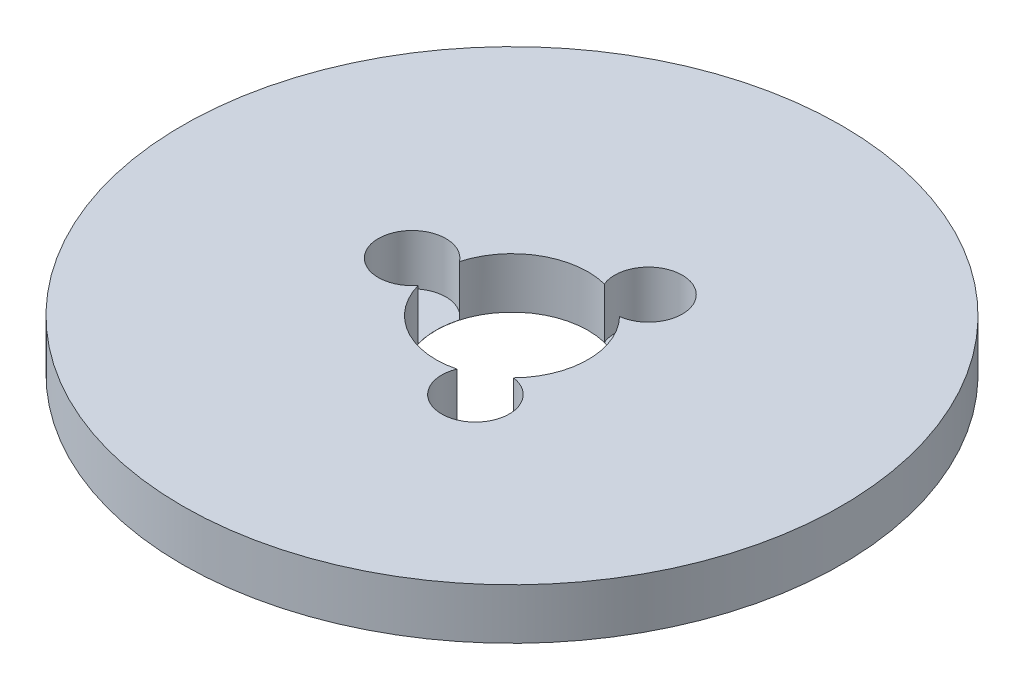
ISO-10303-21;
HEADER;
FILE_DESCRIPTION(('STEP AP214'),'2;1');
FILE_NAME('part.step','',(''),(''),'','','');
FILE_SCHEMA(('AUTOMOTIVE_DESIGN { 1 0 10303 214 1 1 1 1 }'));
ENDSEC;
DATA;
#1=APPLICATION_CONTEXT('core data for automotive mechanical design processes');
#2=APPLICATION_PROTOCOL_DEFINITION('international standard','automotive_design',2000,#1);
#3=PRODUCT_CONTEXT('',#1,'mechanical');
#4=PRODUCT('Part','Part','',(#3));
#5=PRODUCT_RELATED_PRODUCT_CATEGORY('part','',(#4));
#6=PRODUCT_DEFINITION_FORMATION('','',#4);
#7=PRODUCT_DEFINITION_CONTEXT('part definition',#1,'design');
#8=PRODUCT_DEFINITION('design','',#6,#7);
#9=PRODUCT_DEFINITION_SHAPE('','',#8);
#10=(LENGTH_UNIT() NAMED_UNIT(*) SI_UNIT(.MILLI.,.METRE.));
#11=(NAMED_UNIT(*) PLANE_ANGLE_UNIT() SI_UNIT($,.RADIAN.));
#12=(NAMED_UNIT(*) SI_UNIT($,.STERADIAN.) SOLID_ANGLE_UNIT());
#13=UNCERTAINTY_MEASURE_WITH_UNIT(LENGTH_MEASURE(1.E-05),#10,'distance_accuracy_value','');
#14=(GEOMETRIC_REPRESENTATION_CONTEXT(3) GLOBAL_UNCERTAINTY_ASSIGNED_CONTEXT((#13)) GLOBAL_UNIT_ASSIGNED_CONTEXT((#10,
#11,#12)) REPRESENTATION_CONTEXT('',''));
#15=CARTESIAN_POINT('',(0.,0.,0.));
#16=DIRECTION('',(0.,0.,1.));
#17=DIRECTION('',(1.,0.,0.));
#18=AXIS2_PLACEMENT_3D('',#15,#16,#17);
#19=CARTESIAN_POINT('',(0.,15.,0.));
#20=DIRECTION('',(0.,-1.,0.));
#21=DIRECTION('',(0.,0.,-1.));
#22=AXIS2_PLACEMENT_3D('',#19,#20,#21);
#23=CYLINDRICAL_SURFACE('',#22,97.5);
#24=CARTESIAN_POINT('',(0.,15.,0.));
#25=DIRECTION('',(0.,1.,0.));
#26=DIRECTION('',(0.,0.,1.));
#27=AXIS2_PLACEMENT_3D('',#24,#25,#26);
#28=CIRCLE('',#27,97.5);
#29=CARTESIAN_POINT('',(0.,15.,97.5));
#30=VERTEX_POINT('',#29);
#31=EDGE_CURVE('E126',#30,#30,#28,.T.);
#32=ORIENTED_EDGE('',*,*,#31,.F.);
#33=EDGE_LOOP('',(#32));
#34=FACE_BOUND('',#33,.T.);
#35=CARTESIAN_POINT('',(0.,0.,0.));
#36=DIRECTION('',(0.,1.,0.));
#37=DIRECTION('',(0.,0.,1.));
#38=AXIS2_PLACEMENT_3D('',#35,#36,#37);
#39=CIRCLE('',#38,97.5);
#40=CARTESIAN_POINT('',(0.,0.,97.5));
#41=VERTEX_POINT('',#40);
#42=EDGE_CURVE('E124',#41,#41,#39,.T.);
#43=ORIENTED_EDGE('',*,*,#42,.T.);
#44=EDGE_LOOP('',(#43));
#45=FACE_BOUND('',#44,.T.);
#46=ADVANCED_FACE('F39',(#34,#45),#23,.T.);
#47=CARTESIAN_POINT('',(0.,15.,0.));
#48=DIRECTION('',(0.,1.,0.));
#49=DIRECTION('',(0.,0.,1.));
#50=AXIS2_PLACEMENT_3D('',#47,#48,#49);
#51=PLANE('',#50);
#52=CARTESIAN_POINT('',(14.7780542869339,15.,25.5963408619802));
#53=DIRECTION('',(0.,1.,0.));
#54=DIRECTION('',(0.866025403784436,0.,-0.500000000000004));
#55=AXIS2_PLACEMENT_3D('',#52,#53,#54);
#56=CIRCLE('',#55,10.);
#57=CARTESIAN_POINT('',(5.52180645461535,15.,21.8119154013986));
#58=VERTEX_POINT('',#57);
#59=CARTESIAN_POINT('',(16.1287696155007,15.,15.6879823651769));
#60=VERTEX_POINT('',#59);
#61=EDGE_CURVE('E147',#58,#60,#56,.T.);
#62=ORIENTED_EDGE('',*,*,#61,.F.);
#63=CARTESIAN_POINT('',(0.,15.,0.));
#64=DIRECTION('',(0.,1.,0.));
#65=DIRECTION('',(0.,0.,1.));
#66=AXIS2_PLACEMENT_3D('',#63,#64,#65);
#67=CIRCLE('',#66,22.5);
#68=CARTESIAN_POINT('',(-21.6505760701159,15.,6.12393303622161));
#69=VERTEX_POINT('',#68);
#70=EDGE_CURVE('E118',#69,#58,#67,.T.);
#71=ORIENTED_EDGE('',*,*,#70,.F.);
#72=CARTESIAN_POINT('',(-29.5561085738675,15.,0.));
#73=DIRECTION('',(0.,1.,0.));
#74=DIRECTION('',(0.,0.,1.));
#75=AXIS2_PLACEMENT_3D('',#72,#73,#74);
#76=CIRCLE('',#75,10.);
#77=CARTESIAN_POINT('',(-21.6505760701159,15.,-6.12393303622161));
#78=VERTEX_POINT('',#77);
#79=EDGE_CURVE('E113',#78,#69,#76,.T.);
#80=ORIENTED_EDGE('',*,*,#79,.F.);
#81=CARTESIAN_POINT('',(5.52180645461505,15.,-21.8119154013987));
#82=VERTEX_POINT('',#81);
#83=EDGE_CURVE('E106',#82,#78,#67,.T.);
#84=ORIENTED_EDGE('',*,*,#83,.F.);
#85=CARTESIAN_POINT('',(14.7780542869335,15.,-25.5963408619804));
#86=DIRECTION('',(0.,1.,0.));
#87=DIRECTION('',(-0.866025403784443,0.,-0.499999999999992));
#88=AXIS2_PLACEMENT_3D('',#85,#86,#87);
#89=CIRCLE('',#88,10.);
#90=CARTESIAN_POINT('',(16.1287696155005,15.,-15.6879823651771));
#91=VERTEX_POINT('',#90);
#92=EDGE_CURVE('E90',#91,#82,#89,.T.);
#93=ORIENTED_EDGE('',*,*,#92,.F.);
#94=EDGE_CURVE('E116',#60,#91,#67,.T.);
#95=ORIENTED_EDGE('',*,*,#94,.F.);
#96=EDGE_LOOP('',(#62,#71,#80,#84,#93,#95));
#97=FACE_BOUND('',#96,.T.);
#98=ORIENTED_EDGE('',*,*,#31,.T.);
#99=EDGE_LOOP('',(#98));
#100=FACE_BOUND('',#99,.T.);
#101=ADVANCED_FACE('F115',(#97,#100),#51,.T.);
#102=CARTESIAN_POINT('',(0.,0.,0.));
#103=DIRECTION('',(0.,1.,0.));
#104=DIRECTION('',(0.,0.,1.));
#105=AXIS2_PLACEMENT_3D('',#102,#103,#104);
#106=PLANE('',#105);
#107=CARTESIAN_POINT('',(0.,0.,0.));
#108=DIRECTION('',(0.,1.,0.));
#109=DIRECTION('',(0.,0.,1.));
#110=AXIS2_PLACEMENT_3D('',#107,#108,#109);
#111=CIRCLE('',#110,22.5);
#112=CARTESIAN_POINT('',(0.,0.,22.5));
#113=VERTEX_POINT('',#112);
#114=EDGE_CURVE('E120',#113,#113,#111,.T.);
#115=ORIENTED_EDGE('',*,*,#114,.T.);
#116=EDGE_LOOP('',(#115));
#117=FACE_BOUND('',#116,.T.);
#118=ORIENTED_EDGE('',*,*,#42,.F.);
#119=EDGE_LOOP('',(#118));
#120=FACE_BOUND('',#119,.T.);
#121=ADVANCED_FACE('F164',(#117,#120),#106,.F.);
#122=CARTESIAN_POINT('',(0.,15.,0.));
#123=DIRECTION('',(0.,-1.,0.));
#124=DIRECTION('',(0.,0.,-1.));
#125=AXIS2_PLACEMENT_3D('',#122,#123,#124);
#126=CYLINDRICAL_SURFACE('',#125,22.5);
#127=DIRECTION('',(0.,1.,0.));
#128=VECTOR('',#127,1.);
#129=CARTESIAN_POINT('',(5.52180645461536,7.51973039031811,21.8119154013986));
#130=LINE('',#129,#128);
#131=CARTESIAN_POINT('',(5.52180645461535,0.0394607806362274,21.8119154013986));
#132=VERTEX_POINT('',#131);
#133=EDGE_CURVE('E11',#132,#58,#130,.T.);
#134=ORIENTED_EDGE('',*,*,#133,.F.);
#135=CARTESIAN_POINT('',(0.,0.0394607806362274,0.));
#136=DIRECTION('',(0.,1.,0.));
#137=DIRECTION('',(0.,0.,1.));
#138=AXIS2_PLACEMENT_3D('',#135,#136,#137);
#139=CIRCLE('',#138,22.5);
#140=CARTESIAN_POINT('',(16.1287696155007,0.0394607806362274,15.6879823651769));
#141=VERTEX_POINT('',#140);
#142=EDGE_CURVE('E144',#132,#141,#139,.T.);
#143=ORIENTED_EDGE('',*,*,#142,.T.);
#144=DIRECTION('',(0.,1.,0.));
#145=VECTOR('',#144,1.);
#146=CARTESIAN_POINT('',(16.1287696155007,7.51973039031811,15.6879823651769));
#147=LINE('',#146,#145);
#148=EDGE_CURVE('E46',#60,#141,#147,.F.);
#149=ORIENTED_EDGE('',*,*,#148,.F.);
#150=ORIENTED_EDGE('',*,*,#94,.T.);
#151=DIRECTION('',(0.,1.,0.));
#152=VECTOR('',#151,1.);
#153=CARTESIAN_POINT('',(16.1287696155005,7.51973039031811,-15.6879823651771));
#154=LINE('',#153,#152);
#155=CARTESIAN_POINT('',(16.1287696155005,0.0394607806362274,-15.6879823651771));
#156=VERTEX_POINT('',#155);
#157=EDGE_CURVE('E92',#156,#91,#154,.T.);
#158=ORIENTED_EDGE('',*,*,#157,.F.);
#159=CARTESIAN_POINT('',(0.,0.0394607806362274,0.));
#160=DIRECTION('',(0.,1.,0.));
#161=DIRECTION('',(0.,0.,1.));
#162=AXIS2_PLACEMENT_3D('',#159,#160,#161);
#163=CIRCLE('',#162,22.5);
#164=CARTESIAN_POINT('',(5.52180645461505,0.0394607806362274,-21.8119154013987));
#165=VERTEX_POINT('',#164);
#166=EDGE_CURVE('E107',#156,#165,#163,.T.);
#167=ORIENTED_EDGE('',*,*,#166,.T.);
#168=DIRECTION('',(0.,1.,0.));
#169=VECTOR('',#168,1.);
#170=CARTESIAN_POINT('',(5.52180645461505,7.51973039031811,-21.8119154013987));
#171=LINE('',#170,#169);
#172=EDGE_CURVE('E95',#82,#165,#171,.F.);
#173=ORIENTED_EDGE('',*,*,#172,.F.);
#174=ORIENTED_EDGE('',*,*,#83,.T.);
#175=DIRECTION('',(0.,1.,0.));
#176=VECTOR('',#175,1.);
#177=CARTESIAN_POINT('',(-21.6505760701159,7.51973039031811,-6.1239330362216));
#178=LINE('',#177,#176);
#179=CARTESIAN_POINT('',(-21.6505760701159,0.0394607806362274,-6.12393303622161));
#180=VERTEX_POINT('',#179);
#181=EDGE_CURVE('E143',#180,#78,#178,.T.);
#182=ORIENTED_EDGE('',*,*,#181,.F.);
#183=CARTESIAN_POINT('',(0.,0.0394607806362274,0.));
#184=DIRECTION('',(0.,1.,0.));
#185=DIRECTION('',(0.,0.,1.));
#186=AXIS2_PLACEMENT_3D('',#183,#184,#185);
#187=CIRCLE('',#186,22.5);
#188=CARTESIAN_POINT('',(-21.6505760701159,0.0394607806362274,6.12393303622161));
#189=VERTEX_POINT('',#188);
#190=EDGE_CURVE('E132',#180,#189,#187,.T.);
#191=ORIENTED_EDGE('',*,*,#190,.T.);
#192=DIRECTION('',(0.,1.,0.));
#193=VECTOR('',#192,1.);
#194=CARTESIAN_POINT('',(-21.6505760701159,7.51973039031811,6.1239330362216));
#195=LINE('',#194,#193);
#196=EDGE_CURVE('E137',#69,#189,#195,.F.);
#197=ORIENTED_EDGE('',*,*,#196,.F.);
#198=ORIENTED_EDGE('',*,*,#70,.T.);
#199=EDGE_LOOP('',(#134,#143,#149,#150,#158,#167,#173,#174,#182,#191,#197,#198));
#200=FACE_BOUND('',#199,.T.);
#201=ORIENTED_EDGE('',*,*,#114,.F.);
#202=EDGE_LOOP('',(#201));
#203=FACE_BOUND('',#202,.T.);
#204=ADVANCED_FACE('F103',(#200,#203),#126,.F.);
#205=CARTESIAN_POINT('',(-29.5561085738675,0.0394607806362274,0.));
#206=DIRECTION('',(0.,1.,0.));
#207=DIRECTION('',(0.,0.,1.));
#208=AXIS2_PLACEMENT_3D('',#205,#206,#207);
#209=CYLINDRICAL_SURFACE('',#208,10.);
#210=ORIENTED_EDGE('',*,*,#181,.T.);
#211=ORIENTED_EDGE('',*,*,#79,.T.);
#212=ORIENTED_EDGE('',*,*,#196,.T.);
#213=CARTESIAN_POINT('',(-29.5561085738675,0.0394607806362274,0.));
#214=DIRECTION('',(0.,1.,0.));
#215=DIRECTION('',(0.,0.,1.));
#216=AXIS2_PLACEMENT_3D('',#213,#214,#215);
#217=CIRCLE('',#216,10.);
#218=EDGE_CURVE('E121',#180,#189,#217,.T.);
#219=ORIENTED_EDGE('',*,*,#218,.F.);
#220=EDGE_LOOP('',(#210,#211,#212,#219));
#221=FACE_BOUND('',#220,.T.);
#222=ADVANCED_FACE('F174',(#221),#209,.F.);
#223=CARTESIAN_POINT('',(-29.5561085738675,0.0394607806362274,0.));
#224=DIRECTION('',(0.,1.,0.));
#225=DIRECTION('',(0.,0.,1.));
#226=AXIS2_PLACEMENT_3D('',#223,#224,#225);
#227=PLANE('',#226);
#228=ORIENTED_EDGE('',*,*,#218,.T.);
#229=ORIENTED_EDGE('',*,*,#190,.F.);
#230=EDGE_LOOP('',(#228,#229));
#231=FACE_BOUND('',#230,.T.);
#232=ADVANCED_FACE('F177',(#231),#227,.T.);
#233=CARTESIAN_POINT('',(14.7780542869335,0.0394607806362274,-25.5963408619804));
#234=DIRECTION('',(0.,1.,0.));
#235=DIRECTION('',(0.,0.,1.));
#236=AXIS2_PLACEMENT_3D('',#233,#234,#235);
#237=CYLINDRICAL_SURFACE('',#236,10.);
#238=ORIENTED_EDGE('',*,*,#157,.T.);
#239=ORIENTED_EDGE('',*,*,#92,.T.);
#240=ORIENTED_EDGE('',*,*,#172,.T.);
#241=CARTESIAN_POINT('',(14.7780542869335,0.0394607806362274,-25.5963408619804));
#242=DIRECTION('',(0.,1.,0.));
#243=DIRECTION('',(-0.866025403784443,0.,-0.499999999999992));
#244=AXIS2_PLACEMENT_3D('',#241,#242,#243);
#245=CIRCLE('',#244,10.);
#246=EDGE_CURVE('E56',#156,#165,#245,.T.);
#247=ORIENTED_EDGE('',*,*,#246,.F.);
#248=EDGE_LOOP('',(#238,#239,#240,#247));
#249=FACE_BOUND('',#248,.T.);
#250=ADVANCED_FACE('F93',(#249),#237,.F.);
#251=CARTESIAN_POINT('',(14.7780542869335,0.0394607806362274,-25.5963408619804));
#252=DIRECTION('',(0.,1.,0.));
#253=DIRECTION('',(-0.866025403784443,0.,-0.499999999999992));
#254=AXIS2_PLACEMENT_3D('',#251,#252,#253);
#255=PLANE('',#254);
#256=ORIENTED_EDGE('',*,*,#246,.T.);
#257=ORIENTED_EDGE('',*,*,#166,.F.);
#258=EDGE_LOOP('',(#256,#257));
#259=FACE_BOUND('',#258,.T.);
#260=ADVANCED_FACE('F160',(#259),#255,.T.);
#261=CARTESIAN_POINT('',(14.7780542869339,0.0394607806362274,25.5963408619802));
#262=DIRECTION('',(0.,1.,0.));
#263=DIRECTION('',(0.,0.,1.));
#264=AXIS2_PLACEMENT_3D('',#261,#262,#263);
#265=CYLINDRICAL_SURFACE('',#264,10.);
#266=ORIENTED_EDGE('',*,*,#133,.T.);
#267=ORIENTED_EDGE('',*,*,#61,.T.);
#268=ORIENTED_EDGE('',*,*,#148,.T.);
#269=CARTESIAN_POINT('',(14.7780542869339,0.0394607806362274,25.5963408619802));
#270=DIRECTION('',(0.,1.,0.));
#271=DIRECTION('',(0.866025403784436,0.,-0.500000000000004));
#272=AXIS2_PLACEMENT_3D('',#269,#270,#271);
#273=CIRCLE('',#272,10.);
#274=EDGE_CURVE('E55',#132,#141,#273,.T.);
#275=ORIENTED_EDGE('',*,*,#274,.F.);
#276=EDGE_LOOP('',(#266,#267,#268,#275));
#277=FACE_BOUND('',#276,.T.);
#278=ADVANCED_FACE('F149',(#277),#265,.F.);
#279=CARTESIAN_POINT('',(14.7780542869339,0.0394607806362274,25.5963408619802));
#280=DIRECTION('',(0.,1.,0.));
#281=DIRECTION('',(0.866025403784436,0.,-0.500000000000004));
#282=AXIS2_PLACEMENT_3D('',#279,#280,#281);
#283=PLANE('',#282);
#284=ORIENTED_EDGE('',*,*,#274,.T.);
#285=ORIENTED_EDGE('',*,*,#142,.F.);
#286=EDGE_LOOP('',(#284,#285));
#287=FACE_BOUND('',#286,.T.);
#288=ADVANCED_FACE('F151',(#287),#283,.T.);
#289=CLOSED_SHELL('',(#46,#101,#121,#204,#222,#232,#250,#260,#278,#288));
#290=MANIFOLD_SOLID_BREP('B2',#289);
#291=ADVANCED_BREP_SHAPE_REPRESENTATION('',(#18,#290),#14);
#292=SHAPE_DEFINITION_REPRESENTATION(#9,#291);
ENDSEC;
END-ISO-10303-21;
